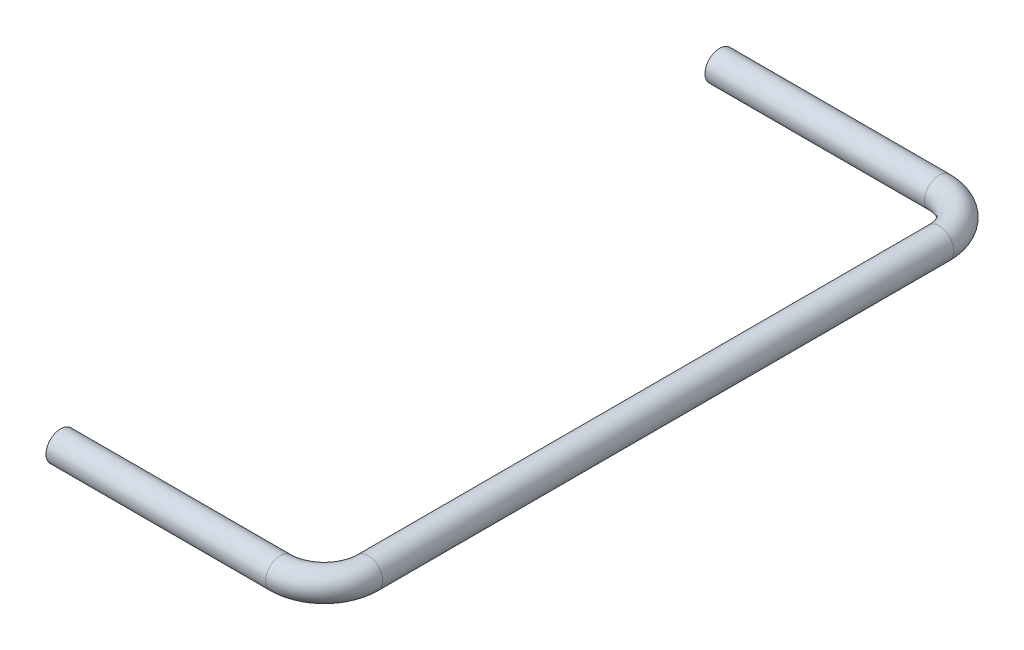
ISO-10303-21;
HEADER;
FILE_DESCRIPTION(('STEP AP214'),'2;1');
FILE_NAME('part.step','',(''),(''),'','','');
FILE_SCHEMA(('AUTOMOTIVE_DESIGN { 1 0 10303 214 1 1 1 1 }'));
ENDSEC;
DATA;
#1=APPLICATION_CONTEXT('core data for automotive mechanical design processes');
#2=APPLICATION_PROTOCOL_DEFINITION('international standard','automotive_design',2000,#1);
#3=PRODUCT_CONTEXT('',#1,'mechanical');
#4=PRODUCT('Part','Part','',(#3));
#5=PRODUCT_RELATED_PRODUCT_CATEGORY('part','',(#4));
#6=PRODUCT_DEFINITION_FORMATION('','',#4);
#7=PRODUCT_DEFINITION_CONTEXT('part definition',#1,'design');
#8=PRODUCT_DEFINITION('design','',#6,#7);
#9=PRODUCT_DEFINITION_SHAPE('','',#8);
#10=(LENGTH_UNIT() NAMED_UNIT(*) SI_UNIT(.MILLI.,.METRE.));
#11=(NAMED_UNIT(*) PLANE_ANGLE_UNIT() SI_UNIT($,.RADIAN.));
#12=(NAMED_UNIT(*) SI_UNIT($,.STERADIAN.) SOLID_ANGLE_UNIT());
#13=UNCERTAINTY_MEASURE_WITH_UNIT(LENGTH_MEASURE(1.E-05),#10,'distance_accuracy_value','');
#14=(GEOMETRIC_REPRESENTATION_CONTEXT(3) GLOBAL_UNCERTAINTY_ASSIGNED_CONTEXT((#13)) GLOBAL_UNIT_ASSIGNED_CONTEXT((#10,
#11,#12)) REPRESENTATION_CONTEXT('',''));
#15=CARTESIAN_POINT('',(0.,0.,0.));
#16=DIRECTION('',(0.,0.,1.));
#17=DIRECTION('',(1.,0.,0.));
#18=AXIS2_PLACEMENT_3D('',#15,#16,#17);
#19=CARTESIAN_POINT('',(15.,0.,-45.));
#20=DIRECTION('',(-1.,0.,0.));
#21=DIRECTION('',(0.,0.,1.));
#22=AXIS2_PLACEMENT_3D('',#19,#20,#21);
#23=CYLINDRICAL_SURFACE('',#22,1.);
#24=CARTESIAN_POINT('',(15.,0.,-45.));
#25=DIRECTION('',(-1.,0.,0.));
#26=DIRECTION('',(0.,0.,1.));
#27=AXIS2_PLACEMENT_3D('',#24,#25,#26);
#28=CIRCLE('',#27,1.);
#29=CARTESIAN_POINT('',(15.,0.,-46.));
#30=VERTEX_POINT('',#29);
#31=EDGE_CURVE('E38',#30,#30,#28,.T.);
#32=ORIENTED_EDGE('',*,*,#31,.T.);
#33=EDGE_LOOP('',(#32));
#34=FACE_BOUND('',#33,.T.);
#35=CARTESIAN_POINT('',(0.,0.,-45.));
#36=DIRECTION('',(-1.,0.,0.));
#37=DIRECTION('',(0.,0.,1.));
#38=AXIS2_PLACEMENT_3D('',#35,#36,#37);
#39=CIRCLE('',#38,1.);
#40=CARTESIAN_POINT('',(0.,0.,-44.));
#41=VERTEX_POINT('',#40);
#42=EDGE_CURVE('E10',#41,#41,#39,.T.);
#43=ORIENTED_EDGE('',*,*,#42,.F.);
#44=EDGE_LOOP('',(#43));
#45=FACE_BOUND('',#44,.T.);
#46=ADVANCED_FACE('F32',(#34,#45),#23,.T.);
#47=CARTESIAN_POINT('',(15.,0.,-42.));
#48=DIRECTION('',(0.,1.,0.));
#49=DIRECTION('',(0.,0.,1.));
#50=AXIS2_PLACEMENT_3D('',#47,#48,#49);
#51=TOROIDAL_SURFACE('',#50,3.,1.);
#52=CARTESIAN_POINT('',(18.,0.,-42.));
#53=DIRECTION('',(0.,0.,-1.));
#54=DIRECTION('',(-1.,0.,0.));
#55=AXIS2_PLACEMENT_3D('',#52,#53,#54);
#56=CIRCLE('',#55,1.);
#57=CARTESIAN_POINT('',(19.,0.,-42.));
#58=VERTEX_POINT('',#57);
#59=EDGE_CURVE('E42',#58,#58,#56,.T.);
#60=CARTESIAN_POINT('',(15.,0.,-42.));
#61=DIRECTION('',(0.,1.,0.));
#62=DIRECTION('',(0.,0.,1.));
#63=AXIS2_PLACEMENT_3D('',#60,#61,#62);
#64=CIRCLE('',#63,4.);
#65=EDGE_CURVE('',#58,#30,#64,.T.);
#66=ORIENTED_EDGE('',*,*,#59,.T.);
#67=ORIENTED_EDGE('',*,*,#31,.F.);
#68=ORIENTED_EDGE('',*,*,#65,.T.);
#69=ORIENTED_EDGE('',*,*,#65,.F.);
#70=EDGE_LOOP('',(#66,#68,#67,#69));
#71=FACE_BOUND('',#70,.T.);
#72=ADVANCED_FACE('F76',(#71),#51,.T.);
#73=CARTESIAN_POINT('',(18.,0.,-3.));
#74=DIRECTION('',(0.,0.,-1.));
#75=DIRECTION('',(-1.,0.,0.));
#76=AXIS2_PLACEMENT_3D('',#73,#74,#75);
#77=CYLINDRICAL_SURFACE('',#76,1.);
#78=CARTESIAN_POINT('',(18.,0.,-3.));
#79=DIRECTION('',(0.,0.,-1.));
#80=DIRECTION('',(-1.,0.,0.));
#81=AXIS2_PLACEMENT_3D('',#78,#79,#80);
#82=CIRCLE('',#81,1.);
#83=CARTESIAN_POINT('',(19.,0.,-3.));
#84=VERTEX_POINT('',#83);
#85=EDGE_CURVE('E46',#84,#84,#82,.T.);
#86=ORIENTED_EDGE('',*,*,#85,.T.);
#87=EDGE_LOOP('',(#86));
#88=FACE_BOUND('',#87,.T.);
#89=ORIENTED_EDGE('',*,*,#59,.F.);
#90=EDGE_LOOP('',(#89));
#91=FACE_BOUND('',#90,.T.);
#92=ADVANCED_FACE('F80',(#88,#91),#77,.T.);
#93=CARTESIAN_POINT('',(15.,0.,-3.));
#94=DIRECTION('',(0.,1.,0.));
#95=DIRECTION('',(0.,0.,1.));
#96=AXIS2_PLACEMENT_3D('',#93,#94,#95);
#97=TOROIDAL_SURFACE('',#96,3.,1.);
#98=CARTESIAN_POINT('',(15.,0.,0.));
#99=DIRECTION('',(1.,0.,0.));
#100=DIRECTION('',(0.,0.,-1.));
#101=AXIS2_PLACEMENT_3D('',#98,#99,#100);
#102=CIRCLE('',#101,1.);
#103=CARTESIAN_POINT('',(15.,0.,1.));
#104=VERTEX_POINT('',#103);
#105=EDGE_CURVE('E51',#104,#104,#102,.T.);
#106=CARTESIAN_POINT('',(15.,0.,-3.));
#107=DIRECTION('',(0.,1.,0.));
#108=DIRECTION('',(0.,0.,1.));
#109=AXIS2_PLACEMENT_3D('',#106,#107,#108);
#110=CIRCLE('',#109,4.);
#111=EDGE_CURVE('',#104,#84,#110,.T.);
#112=ORIENTED_EDGE('',*,*,#105,.T.);
#113=ORIENTED_EDGE('',*,*,#85,.F.);
#114=ORIENTED_EDGE('',*,*,#111,.T.);
#115=ORIENTED_EDGE('',*,*,#111,.F.);
#116=EDGE_LOOP('',(#112,#114,#113,#115));
#117=FACE_BOUND('',#116,.T.);
#118=ADVANCED_FACE('F58',(#117),#97,.T.);
#119=CARTESIAN_POINT('',(15.,0.,0.));
#120=DIRECTION('',(-1.,0.,0.));
#121=DIRECTION('',(0.,0.,1.));
#122=AXIS2_PLACEMENT_3D('',#119,#120,#121);
#123=CYLINDRICAL_SURFACE('',#122,1.);
#124=ORIENTED_EDGE('',*,*,#105,.F.);
#125=EDGE_LOOP('',(#124));
#126=FACE_BOUND('',#125,.T.);
#127=CARTESIAN_POINT('',(0.,0.,0.));
#128=DIRECTION('',(1.,0.,0.));
#129=DIRECTION('',(0.,0.,-1.));
#130=AXIS2_PLACEMENT_3D('',#127,#128,#129);
#131=CIRCLE('',#130,1.);
#132=CARTESIAN_POINT('',(0.,0.,-1.));
#133=VERTEX_POINT('',#132);
#134=EDGE_CURVE('E52',#133,#133,#131,.T.);
#135=ORIENTED_EDGE('',*,*,#134,.T.);
#136=EDGE_LOOP('',(#135));
#137=FACE_BOUND('',#136,.T.);
#138=ADVANCED_FACE('F61',(#126,#137),#123,.T.);
#139=CARTESIAN_POINT('',(0.,0.,-45.));
#140=DIRECTION('',(-1.,0.,0.));
#141=DIRECTION('',(0.,0.,1.));
#142=AXIS2_PLACEMENT_3D('',#139,#140,#141);
#143=PLANE('',#142);
#144=ORIENTED_EDGE('',*,*,#42,.T.);
#145=EDGE_LOOP('',(#144));
#146=FACE_BOUND('',#145,.T.);
#147=ADVANCED_FACE('F64',(#146),#143,.T.);
#148=CARTESIAN_POINT('',(0.,0.,0.));
#149=DIRECTION('',(1.,0.,0.));
#150=DIRECTION('',(0.,0.,-1.));
#151=AXIS2_PLACEMENT_3D('',#148,#149,#150);
#152=PLANE('',#151);
#153=ORIENTED_EDGE('',*,*,#134,.F.);
#154=EDGE_LOOP('',(#153));
#155=FACE_BOUND('',#154,.T.);
#156=ADVANCED_FACE('F68',(#155),#152,.F.);
#157=CLOSED_SHELL('',(#46,#72,#92,#118,#138,#147,#156));
#158=MANIFOLD_SOLID_BREP('B2',#157);
#159=ADVANCED_BREP_SHAPE_REPRESENTATION('',(#18,#158),#14);
#160=SHAPE_DEFINITION_REPRESENTATION(#9,#159);
ENDSEC;
END-ISO-10303-21;
